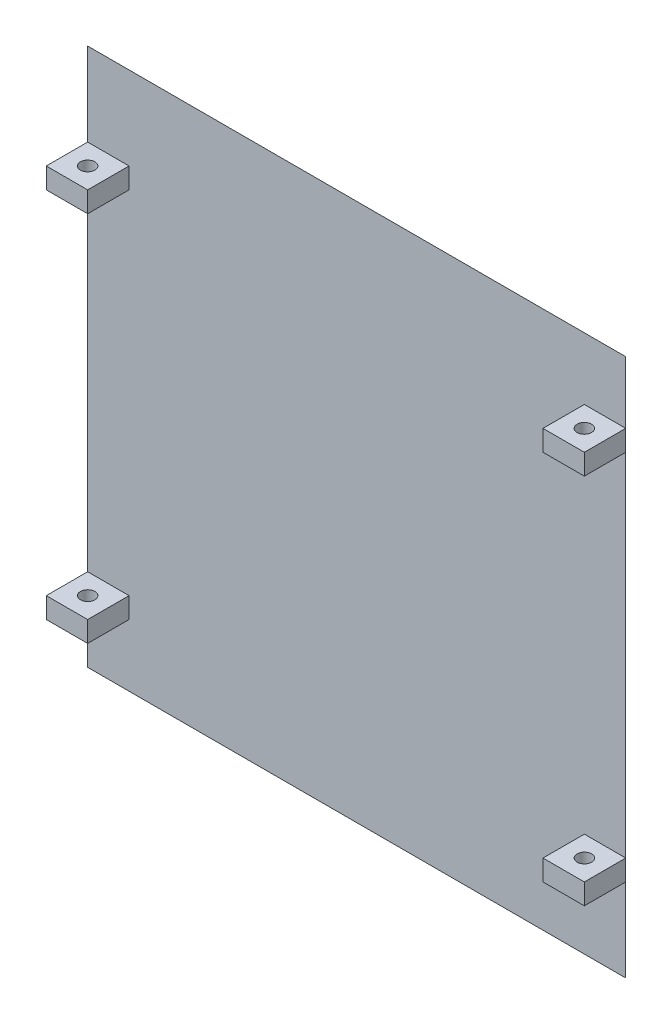
ISO-10303-21;
HEADER;
FILE_DESCRIPTION(('STEP AP214'),'2;1');
FILE_NAME('part.step','',(''),(''),'','','');
FILE_SCHEMA(('AUTOMOTIVE_DESIGN { 1 0 10303 214 1 1 1 1 }'));
ENDSEC;
DATA;
#1=APPLICATION_CONTEXT('core data for automotive mechanical design processes');
#2=APPLICATION_PROTOCOL_DEFINITION('international standard','automotive_design',2000,#1);
#3=PRODUCT_CONTEXT('',#1,'mechanical');
#4=PRODUCT('Part','Part','',(#3));
#5=PRODUCT_RELATED_PRODUCT_CATEGORY('part','',(#4));
#6=PRODUCT_DEFINITION_FORMATION('','',#4);
#7=PRODUCT_DEFINITION_CONTEXT('part definition',#1,'design');
#8=PRODUCT_DEFINITION('design','',#6,#7);
#9=PRODUCT_DEFINITION_SHAPE('','',#8);
#10=(LENGTH_UNIT() NAMED_UNIT(*) SI_UNIT(.MILLI.,.METRE.));
#11=(NAMED_UNIT(*) PLANE_ANGLE_UNIT() SI_UNIT($,.RADIAN.));
#12=(NAMED_UNIT(*) SI_UNIT($,.STERADIAN.) SOLID_ANGLE_UNIT());
#13=UNCERTAINTY_MEASURE_WITH_UNIT(LENGTH_MEASURE(1.E-05),#10,'distance_accuracy_value','');
#14=(GEOMETRIC_REPRESENTATION_CONTEXT(3) GLOBAL_UNCERTAINTY_ASSIGNED_CONTEXT((#13)) GLOBAL_UNIT_ASSIGNED_CONTEXT((#10,
#11,#12)) REPRESENTATION_CONTEXT('',''));
#15=CARTESIAN_POINT('',(0.,0.,0.));
#16=DIRECTION('',(0.,0.,1.));
#17=DIRECTION('',(1.,0.,0.));
#18=AXIS2_PLACEMENT_3D('',#15,#16,#17);
#19=CARTESIAN_POINT('',(0.,0.,3.));
#20=DIRECTION('',(0.,0.,1.));
#21=DIRECTION('',(1.,0.,0.));
#22=AXIS2_PLACEMENT_3D('',#19,#20,#21);
#23=PLANE('',#22);
#24=DIRECTION('',(0.,-1.,0.));
#25=VECTOR('',#24,1.);
#26=CARTESIAN_POINT('',(120.,110.,3.));
#27=LINE('',#26,#25);
#28=CARTESIAN_POINT('',(120.,115.,3.));
#29=VERTEX_POINT('',#28);
#30=CARTESIAN_POINT('',(120.,110.,3.));
#31=VERTEX_POINT('',#30);
#32=EDGE_CURVE('E50',#29,#31,#27,.T.);
#33=ORIENTED_EDGE('',*,*,#32,.F.);
#34=DIRECTION('',(-1.,0.,0.));
#35=VECTOR('',#34,1.);
#36=CARTESIAN_POINT('',(130.,115.,3.));
#37=LINE('',#36,#35);
#38=CARTESIAN_POINT('',(130.,115.,3.));
#39=VERTEX_POINT('',#38);
#40=EDGE_CURVE('E372',#39,#29,#37,.T.);
#41=ORIENTED_EDGE('',*,*,#40,.F.);
#42=DIRECTION('',(0.,1.,0.));
#43=VECTOR('',#42,1.);
#44=CARTESIAN_POINT('',(130.,130.,3.));
#45=LINE('',#44,#43);
#46=CARTESIAN_POINT('',(130.,130.,3.));
#47=VERTEX_POINT('',#46);
#48=EDGE_CURVE('E334',#39,#47,#45,.T.);
#49=ORIENTED_EDGE('',*,*,#48,.T.);
#50=DIRECTION('',(-1.,0.,0.));
#51=VECTOR('',#50,1.);
#52=CARTESIAN_POINT('',(0.,130.,3.));
#53=LINE('',#52,#51);
#54=CARTESIAN_POINT('',(0.,130.,3.));
#55=VERTEX_POINT('',#54);
#56=EDGE_CURVE('E329',#47,#55,#53,.T.);
#57=ORIENTED_EDGE('',*,*,#56,.T.);
#58=DIRECTION('',(0.,-1.,0.));
#59=VECTOR('',#58,1.);
#60=CARTESIAN_POINT('',(0.,130.,3.));
#61=LINE('',#60,#59);
#62=CARTESIAN_POINT('',(0.,109.9,3.));
#63=VERTEX_POINT('',#62);
#64=EDGE_CURVE('E298',#55,#63,#61,.T.);
#65=ORIENTED_EDGE('',*,*,#64,.T.);
#66=DIRECTION('',(-1.,0.,0.));
#67=VECTOR('',#66,1.);
#68=CARTESIAN_POINT('',(0.,109.9,3.));
#69=LINE('',#68,#67);
#70=CARTESIAN_POINT('',(9.99999999999999,109.9,3.));
#71=VERTEX_POINT('',#70);
#72=EDGE_CURVE('E238',#71,#63,#69,.T.);
#73=ORIENTED_EDGE('',*,*,#72,.F.);
#74=DIRECTION('',(0.,1.,0.));
#75=VECTOR('',#74,1.);
#76=CARTESIAN_POINT('',(9.99999999999999,109.9,3.));
#77=LINE('',#76,#75);
#78=CARTESIAN_POINT('',(9.99999999999999,104.9,3.));
#79=VERTEX_POINT('',#78);
#80=EDGE_CURVE('E250',#79,#71,#77,.T.);
#81=ORIENTED_EDGE('',*,*,#80,.F.);
#82=DIRECTION('',(1.,0.,0.));
#83=VECTOR('',#82,1.);
#84=CARTESIAN_POINT('',(0.,104.9,3.));
#85=LINE('',#84,#83);
#86=CARTESIAN_POINT('',(0.,104.9,3.));
#87=VERTEX_POINT('',#86);
#88=EDGE_CURVE('E247',#87,#79,#85,.T.);
#89=ORIENTED_EDGE('',*,*,#88,.F.);
#90=CARTESIAN_POINT('',(0.,20.,3.));
#91=VERTEX_POINT('',#90);
#92=EDGE_CURVE('E296',#87,#91,#61,.T.);
#93=ORIENTED_EDGE('',*,*,#92,.T.);
#94=DIRECTION('',(-1.,0.,0.));
#95=VECTOR('',#94,1.);
#96=CARTESIAN_POINT('',(0.,20.,3.));
#97=LINE('',#96,#95);
#98=CARTESIAN_POINT('',(9.99999999999999,20.,3.));
#99=VERTEX_POINT('',#98);
#100=EDGE_CURVE('E271',#99,#91,#97,.T.);
#101=ORIENTED_EDGE('',*,*,#100,.F.);
#102=DIRECTION('',(0.,1.,0.));
#103=VECTOR('',#102,1.);
#104=CARTESIAN_POINT('',(9.99999999999999,20.,3.));
#105=LINE('',#104,#103);
#106=CARTESIAN_POINT('',(9.99999999999999,15.,3.));
#107=VERTEX_POINT('',#106);
#108=EDGE_CURVE('E278',#107,#99,#105,.T.);
#109=ORIENTED_EDGE('',*,*,#108,.F.);
#110=DIRECTION('',(1.,0.,0.));
#111=VECTOR('',#110,1.);
#112=CARTESIAN_POINT('',(0.,15.,3.));
#113=LINE('',#112,#111);
#114=CARTESIAN_POINT('',(0.,15.,3.));
#115=VERTEX_POINT('',#114);
#116=EDGE_CURVE('E281',#115,#107,#113,.T.);
#117=ORIENTED_EDGE('',*,*,#116,.F.);
#118=CARTESIAN_POINT('',(0.,0.,3.));
#119=VERTEX_POINT('',#118);
#120=EDGE_CURVE('E299',#115,#119,#61,.T.);
#121=ORIENTED_EDGE('',*,*,#120,.T.);
#122=DIRECTION('',(1.,0.,0.));
#123=VECTOR('',#122,1.);
#124=CARTESIAN_POINT('',(0.,0.,3.));
#125=LINE('',#124,#123);
#126=CARTESIAN_POINT('',(130.,0.,3.));
#127=VERTEX_POINT('',#126);
#128=EDGE_CURVE('E304',#119,#127,#125,.T.);
#129=ORIENTED_EDGE('',*,*,#128,.T.);
#130=CARTESIAN_POINT('',(130.,20.1,3.));
#131=VERTEX_POINT('',#130);
#132=EDGE_CURVE('E331',#127,#131,#45,.T.);
#133=ORIENTED_EDGE('',*,*,#132,.T.);
#134=DIRECTION('',(1.,0.,0.));
#135=VECTOR('',#134,1.);
#136=CARTESIAN_POINT('',(130.,20.1,3.));
#137=LINE('',#136,#135);
#138=CARTESIAN_POINT('',(120.,20.1,3.));
#139=VERTEX_POINT('',#138);
#140=EDGE_CURVE('E208',#139,#131,#137,.T.);
#141=ORIENTED_EDGE('',*,*,#140,.F.);
#142=DIRECTION('',(0.,-1.,0.));
#143=VECTOR('',#142,1.);
#144=CARTESIAN_POINT('',(120.,20.1,3.));
#145=LINE('',#144,#143);
#146=CARTESIAN_POINT('',(120.,25.1,3.));
#147=VERTEX_POINT('',#146);
#148=EDGE_CURVE('E217',#147,#139,#145,.T.);
#149=ORIENTED_EDGE('',*,*,#148,.F.);
#150=DIRECTION('',(-1.,0.,0.));
#151=VECTOR('',#150,1.);
#152=CARTESIAN_POINT('',(130.,25.1,3.));
#153=LINE('',#152,#151);
#154=CARTESIAN_POINT('',(130.,25.1,3.));
#155=VERTEX_POINT('',#154);
#156=EDGE_CURVE('E198',#155,#147,#153,.T.);
#157=ORIENTED_EDGE('',*,*,#156,.F.);
#158=CARTESIAN_POINT('',(130.,110.,3.));
#159=VERTEX_POINT('',#158);
#160=EDGE_CURVE('E333',#155,#159,#45,.T.);
#161=ORIENTED_EDGE('',*,*,#160,.T.);
#162=DIRECTION('',(1.,0.,0.));
#163=VECTOR('',#162,1.);
#164=CARTESIAN_POINT('',(130.,110.,3.));
#165=LINE('',#164,#163);
#166=EDGE_CURVE('E55',#31,#159,#165,.T.);
#167=ORIENTED_EDGE('',*,*,#166,.F.);
#168=EDGE_LOOP('',(#33,#41,#49,#57,#65,#73,#81,#89,#93,#101,#109,#117,#121,#129,#133,#141,#149,
#157,#161,#167));
#169=FACE_BOUND('',#168,.T.);
#170=ADVANCED_FACE('F33',(#169),#23,.T.);
#171=CARTESIAN_POINT('',(0.,0.,0.));
#172=DIRECTION('',(0.,0.,1.));
#173=DIRECTION('',(1.,0.,0.));
#174=AXIS2_PLACEMENT_3D('',#171,#172,#173);
#175=PLANE('',#174);
#176=DIRECTION('',(0.,1.,0.));
#177=VECTOR('',#176,1.);
#178=CARTESIAN_POINT('',(3.,0.,0.));
#179=LINE('',#178,#177);
#180=CARTESIAN_POINT('',(3.,3.,0.));
#181=VERTEX_POINT('',#180);
#182=CARTESIAN_POINT('',(3.,127.,0.));
#183=VERTEX_POINT('',#182);
#184=EDGE_CURVE('E327',#181,#183,#179,.T.);
#185=ORIENTED_EDGE('',*,*,#184,.T.);
#186=DIRECTION('',(1.,0.,0.));
#187=VECTOR('',#186,1.);
#188=CARTESIAN_POINT('',(0.,127.,0.));
#189=LINE('',#188,#187);
#190=CARTESIAN_POINT('',(127.,127.,0.));
#191=VERTEX_POINT('',#190);
#192=EDGE_CURVE('E11',#183,#191,#189,.T.);
#193=ORIENTED_EDGE('',*,*,#192,.T.);
#194=DIRECTION('',(0.,-1.,0.));
#195=VECTOR('',#194,1.);
#196=CARTESIAN_POINT('',(127.,0.,0.));
#197=LINE('',#196,#195);
#198=CARTESIAN_POINT('',(127.,3.,0.));
#199=VERTEX_POINT('',#198);
#200=EDGE_CURVE('E42',#191,#199,#197,.T.);
#201=ORIENTED_EDGE('',*,*,#200,.T.);
#202=DIRECTION('',(-1.,0.,0.));
#203=VECTOR('',#202,1.);
#204=CARTESIAN_POINT('',(0.,3.,0.));
#205=LINE('',#204,#203);
#206=EDGE_CURVE('E325',#199,#181,#205,.T.);
#207=ORIENTED_EDGE('',*,*,#206,.T.);
#208=EDGE_LOOP('',(#185,#193,#201,#207));
#209=FACE_BOUND('',#208,.T.);
#210=ADVANCED_FACE('F419',(#209),#175,.F.);
#211=CARTESIAN_POINT('',(0.,0.,2.99999999999998));
#212=DIRECTION('',(0.,0.707106781186544,0.707106781186551));
#213=DIRECTION('',(1.,0.,0.));
#214=AXIS2_PLACEMENT_3D('',#211,#212,#213);
#215=PLANE('',#214);
#216=DIRECTION('',(-0.577350269189628,-0.577350269189628,0.577350269189622));
#217=VECTOR('',#216,1.);
#218=CARTESIAN_POINT('',(43.3333333333336,43.3333333333336,-40.3333333333332));
#219=LINE('',#218,#217);
#220=EDGE_CURVE('E316',#181,#119,#219,.T.);
#221=ORIENTED_EDGE('',*,*,#220,.F.);
#222=ORIENTED_EDGE('',*,*,#206,.F.);
#223=DIRECTION('',(0.577350269189631,-0.577350269189626,0.57735026918962));
#224=VECTOR('',#223,1.);
#225=CARTESIAN_POINT('',(86.6666666666658,43.3333333333337,-40.3333333333333));
#226=LINE('',#225,#224);
#227=EDGE_CURVE('E313',#127,#199,#226,.F.);
#228=ORIENTED_EDGE('',*,*,#227,.F.);
#229=ORIENTED_EDGE('',*,*,#128,.F.);
#230=EDGE_LOOP('',(#221,#222,#228,#229));
#231=FACE_BOUND('',#230,.T.);
#232=ADVANCED_FACE('F35',(#231),#215,.F.);
#233=CARTESIAN_POINT('',(130.,130.,2.99999999999998));
#234=DIRECTION('',(-0.707106781186541,0.,0.707106781186554));
#235=DIRECTION('',(0.,1.,0.));
#236=AXIS2_PLACEMENT_3D('',#233,#234,#235);
#237=PLANE('',#236);
#238=ORIENTED_EDGE('',*,*,#227,.T.);
#239=ORIENTED_EDGE('',*,*,#200,.F.);
#240=DIRECTION('',(0.577350269189631,0.577350269189626,0.577350269189621));
#241=VECTOR('',#240,1.);
#242=CARTESIAN_POINT('',(130.,130.,2.99999999999998));
#243=LINE('',#242,#241);
#244=EDGE_CURVE('E319',#47,#191,#243,.F.);
#245=ORIENTED_EDGE('',*,*,#244,.F.);
#246=ORIENTED_EDGE('',*,*,#48,.F.);
#247=DIRECTION('',(0.,1.,0.));
#248=VECTOR('',#247,1.);
#249=CARTESIAN_POINT('',(130.,110.,3.));
#250=LINE('',#249,#248);
#251=EDGE_CURVE('E194',#159,#39,#250,.T.);
#252=ORIENTED_EDGE('',*,*,#251,.F.);
#253=ORIENTED_EDGE('',*,*,#160,.F.);
#254=DIRECTION('',(0.,1.,0.));
#255=VECTOR('',#254,1.);
#256=CARTESIAN_POINT('',(130.,20.1,3.));
#257=LINE('',#256,#255);
#258=EDGE_CURVE('E195',#131,#155,#257,.T.);
#259=ORIENTED_EDGE('',*,*,#258,.F.);
#260=ORIENTED_EDGE('',*,*,#132,.F.);
#261=EDGE_LOOP('',(#238,#239,#245,#246,#252,#253,#259,#260));
#262=FACE_BOUND('',#261,.T.);
#263=ADVANCED_FACE('F345',(#262),#237,.F.);
#264=CARTESIAN_POINT('',(0.,130.,2.99999999999998));
#265=DIRECTION('',(0.707106781186544,0.,0.707106781186551));
#266=DIRECTION('',(0.,-1.,0.));
#267=AXIS2_PLACEMENT_3D('',#264,#265,#266);
#268=PLANE('',#267);
#269=ORIENTED_EDGE('',*,*,#220,.T.);
#270=ORIENTED_EDGE('',*,*,#120,.F.);
#271=DIRECTION('',(0.,-1.,0.));
#272=VECTOR('',#271,1.);
#273=CARTESIAN_POINT('',(0.,20.,3.));
#274=LINE('',#273,#272);
#275=EDGE_CURVE('E266',#91,#115,#274,.T.);
#276=ORIENTED_EDGE('',*,*,#275,.F.);
#277=ORIENTED_EDGE('',*,*,#92,.F.);
#278=DIRECTION('',(0.,-1.,0.));
#279=VECTOR('',#278,1.);
#280=CARTESIAN_POINT('',(0.,109.9,3.));
#281=LINE('',#280,#279);
#282=EDGE_CURVE('E233',#63,#87,#281,.T.);
#283=ORIENTED_EDGE('',*,*,#282,.F.);
#284=ORIENTED_EDGE('',*,*,#64,.F.);
#285=DIRECTION('',(0.577350269189628,-0.577350269189628,-0.577350269189622));
#286=VECTOR('',#285,1.);
#287=CARTESIAN_POINT('',(0.,130.,2.99999999999998));
#288=LINE('',#287,#286);
#289=EDGE_CURVE('E321',#183,#55,#288,.F.);
#290=ORIENTED_EDGE('',*,*,#289,.F.);
#291=ORIENTED_EDGE('',*,*,#184,.F.);
#292=EDGE_LOOP('',(#269,#270,#276,#277,#283,#284,#290,#291));
#293=FACE_BOUND('',#292,.T.);
#294=ADVANCED_FACE('F433',(#293),#268,.F.);
#295=CARTESIAN_POINT('',(0.,130.,2.99999999999998));
#296=DIRECTION('',(0.,-0.707106781186544,0.707106781186551));
#297=DIRECTION('',(-1.,0.,0.));
#298=AXIS2_PLACEMENT_3D('',#295,#296,#297);
#299=PLANE('',#298);
#300=ORIENTED_EDGE('',*,*,#244,.T.);
#301=ORIENTED_EDGE('',*,*,#192,.F.);
#302=ORIENTED_EDGE('',*,*,#289,.T.);
#303=ORIENTED_EDGE('',*,*,#56,.F.);
#304=EDGE_LOOP('',(#300,#301,#302,#303));
#305=FACE_BOUND('',#304,.T.);
#306=ADVANCED_FACE('F430',(#305),#299,.F.);
#307=CARTESIAN_POINT('',(0.,20.,13.));
#308=DIRECTION('',(1.,0.,0.));
#309=DIRECTION('',(0.,1.,0.));
#310=AXIS2_PLACEMENT_3D('',#307,#308,#309);
#311=PLANE('',#310);
#312=ORIENTED_EDGE('',*,*,#275,.T.);
#313=DIRECTION('',(0.,0.,-1.));
#314=VECTOR('',#313,1.);
#315=CARTESIAN_POINT('',(0.,15.,13.));
#316=LINE('',#315,#314);
#317=CARTESIAN_POINT('',(0.,15.,13.));
#318=VERTEX_POINT('',#317);
#319=EDGE_CURVE('E322',#318,#115,#316,.T.);
#320=ORIENTED_EDGE('',*,*,#319,.F.);
#321=DIRECTION('',(0.,-1.,0.));
#322=VECTOR('',#321,1.);
#323=CARTESIAN_POINT('',(0.,20.,13.));
#324=LINE('',#323,#322);
#325=CARTESIAN_POINT('',(0.,20.,13.));
#326=VERTEX_POINT('',#325);
#327=EDGE_CURVE('E267',#326,#318,#324,.T.);
#328=ORIENTED_EDGE('',*,*,#327,.F.);
#329=DIRECTION('',(0.,0.,-1.));
#330=VECTOR('',#329,1.);
#331=CARTESIAN_POINT('',(0.,20.,13.));
#332=LINE('',#331,#330);
#333=EDGE_CURVE('E277',#326,#91,#332,.T.);
#334=ORIENTED_EDGE('',*,*,#333,.T.);
#335=EDGE_LOOP('',(#312,#320,#328,#334));
#336=FACE_BOUND('',#335,.T.);
#337=ADVANCED_FACE('F427',(#336),#311,.F.);
#338=CARTESIAN_POINT('',(0.,15.,13.));
#339=DIRECTION('',(0.,1.,0.));
#340=DIRECTION('',(0.,0.,1.));
#341=AXIS2_PLACEMENT_3D('',#338,#339,#340);
#342=PLANE('',#341);
#343=CARTESIAN_POINT('',(4.99999999999999,15.,8.));
#344=DIRECTION('',(0.,-1.,0.));
#345=DIRECTION('',(0.,0.,-1.));
#346=AXIS2_PLACEMENT_3D('',#343,#344,#345);
#347=CIRCLE('',#346,1.75);
#348=CARTESIAN_POINT('',(4.99999999999999,15.,6.25));
#349=VERTEX_POINT('',#348);
#350=EDGE_CURVE('E382',#349,#349,#347,.T.);
#351=ORIENTED_EDGE('',*,*,#350,.F.);
#352=EDGE_LOOP('',(#351));
#353=FACE_BOUND('',#352,.T.);
#354=ORIENTED_EDGE('',*,*,#116,.T.);
#355=DIRECTION('',(0.,0.,-1.));
#356=VECTOR('',#355,1.);
#357=CARTESIAN_POINT('',(9.99999999999999,15.,13.));
#358=LINE('',#357,#356);
#359=CARTESIAN_POINT('',(9.99999999999999,15.,13.));
#360=VERTEX_POINT('',#359);
#361=EDGE_CURVE('E303',#360,#107,#358,.T.);
#362=ORIENTED_EDGE('',*,*,#361,.F.);
#363=DIRECTION('',(1.,0.,0.));
#364=VECTOR('',#363,1.);
#365=CARTESIAN_POINT('',(0.,15.,13.));
#366=LINE('',#365,#364);
#367=EDGE_CURVE('E270',#318,#360,#366,.T.);
#368=ORIENTED_EDGE('',*,*,#367,.F.);
#369=ORIENTED_EDGE('',*,*,#319,.T.);
#370=EDGE_LOOP('',(#354,#362,#368,#369));
#371=FACE_BOUND('',#370,.T.);
#372=ADVANCED_FACE('F477',(#353,#371),#342,.F.);
#373=CARTESIAN_POINT('',(9.99999999999999,20.,13.));
#374=DIRECTION('',(-1.,0.,0.));
#375=DIRECTION('',(0.,-1.,0.));
#376=AXIS2_PLACEMENT_3D('',#373,#374,#375);
#377=PLANE('',#376);
#378=ORIENTED_EDGE('',*,*,#108,.T.);
#379=DIRECTION('',(0.,0.,-1.));
#380=VECTOR('',#379,1.);
#381=CARTESIAN_POINT('',(9.99999999999999,20.,13.));
#382=LINE('',#381,#380);
#383=CARTESIAN_POINT('',(9.99999999999999,20.,13.));
#384=VERTEX_POINT('',#383);
#385=EDGE_CURVE('E284',#384,#99,#382,.T.);
#386=ORIENTED_EDGE('',*,*,#385,.F.);
#387=DIRECTION('',(0.,1.,0.));
#388=VECTOR('',#387,1.);
#389=CARTESIAN_POINT('',(9.99999999999999,20.,13.));
#390=LINE('',#389,#388);
#391=EDGE_CURVE('E273',#360,#384,#390,.T.);
#392=ORIENTED_EDGE('',*,*,#391,.F.);
#393=ORIENTED_EDGE('',*,*,#361,.T.);
#394=EDGE_LOOP('',(#378,#386,#392,#393));
#395=FACE_BOUND('',#394,.T.);
#396=ADVANCED_FACE('F486',(#395),#377,.F.);
#397=CARTESIAN_POINT('',(0.,20.,13.));
#398=DIRECTION('',(0.,-1.,0.));
#399=DIRECTION('',(0.,0.,-1.));
#400=AXIS2_PLACEMENT_3D('',#397,#398,#399);
#401=PLANE('',#400);
#402=CARTESIAN_POINT('',(4.99999999999999,20.,8.));
#403=DIRECTION('',(0.,-1.,0.));
#404=DIRECTION('',(0.,0.,-1.));
#405=AXIS2_PLACEMENT_3D('',#402,#403,#404);
#406=CIRCLE('',#405,1.75);
#407=CARTESIAN_POINT('',(4.99999999999999,20.,6.25));
#408=VERTEX_POINT('',#407);
#409=EDGE_CURVE('E374',#408,#408,#406,.T.);
#410=ORIENTED_EDGE('',*,*,#409,.T.);
#411=EDGE_LOOP('',(#410));
#412=FACE_BOUND('',#411,.T.);
#413=ORIENTED_EDGE('',*,*,#100,.T.);
#414=ORIENTED_EDGE('',*,*,#333,.F.);
#415=DIRECTION('',(-1.,0.,0.));
#416=VECTOR('',#415,1.);
#417=CARTESIAN_POINT('',(0.,20.,13.));
#418=LINE('',#417,#416);
#419=EDGE_CURVE('E275',#384,#326,#418,.T.);
#420=ORIENTED_EDGE('',*,*,#419,.F.);
#421=ORIENTED_EDGE('',*,*,#385,.T.);
#422=EDGE_LOOP('',(#413,#414,#420,#421));
#423=FACE_BOUND('',#422,.T.);
#424=ADVANCED_FACE('F495',(#412,#423),#401,.F.);
#425=CARTESIAN_POINT('',(0.,0.,13.));
#426=DIRECTION('',(0.,0.,1.));
#427=DIRECTION('',(1.,0.,0.));
#428=AXIS2_PLACEMENT_3D('',#425,#426,#427);
#429=PLANE('',#428);
#430=ORIENTED_EDGE('',*,*,#327,.T.);
#431=ORIENTED_EDGE('',*,*,#367,.T.);
#432=ORIENTED_EDGE('',*,*,#391,.T.);
#433=ORIENTED_EDGE('',*,*,#419,.T.);
#434=EDGE_LOOP('',(#430,#431,#432,#433));
#435=FACE_BOUND('',#434,.T.);
#436=ADVANCED_FACE('F504',(#435),#429,.T.);
#437=CARTESIAN_POINT('',(0.,109.9,13.));
#438=DIRECTION('',(1.,0.,0.));
#439=DIRECTION('',(0.,1.,0.));
#440=AXIS2_PLACEMENT_3D('',#437,#438,#439);
#441=PLANE('',#440);
#442=ORIENTED_EDGE('',*,*,#282,.T.);
#443=DIRECTION('',(0.,0.,-1.));
#444=VECTOR('',#443,1.);
#445=CARTESIAN_POINT('',(0.,104.9,13.));
#446=LINE('',#445,#444);
#447=CARTESIAN_POINT('',(0.,104.9,13.));
#448=VERTEX_POINT('',#447);
#449=EDGE_CURVE('E263',#448,#87,#446,.T.);
#450=ORIENTED_EDGE('',*,*,#449,.F.);
#451=DIRECTION('',(0.,-1.,0.));
#452=VECTOR('',#451,1.);
#453=CARTESIAN_POINT('',(0.,109.9,13.));
#454=LINE('',#453,#452);
#455=CARTESIAN_POINT('',(0.,109.9,13.));
#456=VERTEX_POINT('',#455);
#457=EDGE_CURVE('E234',#456,#448,#454,.T.);
#458=ORIENTED_EDGE('',*,*,#457,.F.);
#459=DIRECTION('',(0.,0.,-1.));
#460=VECTOR('',#459,1.);
#461=CARTESIAN_POINT('',(0.,109.9,13.));
#462=LINE('',#461,#460);
#463=EDGE_CURVE('E244',#456,#63,#462,.T.);
#464=ORIENTED_EDGE('',*,*,#463,.T.);
#465=EDGE_LOOP('',(#442,#450,#458,#464));
#466=FACE_BOUND('',#465,.T.);
#467=ADVANCED_FACE('F513',(#466),#441,.F.);
#468=CARTESIAN_POINT('',(0.,104.9,13.));
#469=DIRECTION('',(0.,1.,0.));
#470=DIRECTION('',(0.,0.,1.));
#471=AXIS2_PLACEMENT_3D('',#468,#469,#470);
#472=PLANE('',#471);
#473=CARTESIAN_POINT('',(4.99999999999999,104.9,8.));
#474=DIRECTION('',(0.,1.,0.));
#475=DIRECTION('',(0.,0.,1.));
#476=AXIS2_PLACEMENT_3D('',#473,#474,#475);
#477=CIRCLE('',#476,1.75);
#478=CARTESIAN_POINT('',(4.99999999999999,104.9,9.75));
#479=VERTEX_POINT('',#478);
#480=EDGE_CURVE('E379',#479,#479,#477,.T.);
#481=ORIENTED_EDGE('',*,*,#480,.T.);
#482=EDGE_LOOP('',(#481));
#483=FACE_BOUND('',#482,.T.);
#484=ORIENTED_EDGE('',*,*,#88,.T.);
#485=DIRECTION('',(0.,0.,-1.));
#486=VECTOR('',#485,1.);
#487=CARTESIAN_POINT('',(9.99999999999999,104.9,13.));
#488=LINE('',#487,#486);
#489=CARTESIAN_POINT('',(9.99999999999999,104.9,13.));
#490=VERTEX_POINT('',#489);
#491=EDGE_CURVE('E260',#490,#79,#488,.T.);
#492=ORIENTED_EDGE('',*,*,#491,.F.);
#493=DIRECTION('',(1.,0.,0.));
#494=VECTOR('',#493,1.);
#495=CARTESIAN_POINT('',(0.,104.9,13.));
#496=LINE('',#495,#494);
#497=EDGE_CURVE('E237',#448,#490,#496,.T.);
#498=ORIENTED_EDGE('',*,*,#497,.F.);
#499=ORIENTED_EDGE('',*,*,#449,.T.);
#500=EDGE_LOOP('',(#484,#492,#498,#499));
#501=FACE_BOUND('',#500,.T.);
#502=ADVANCED_FACE('F522',(#483,#501),#472,.F.);
#503=CARTESIAN_POINT('',(9.99999999999999,109.9,13.));
#504=DIRECTION('',(-1.,0.,0.));
#505=DIRECTION('',(0.,0.,1.));
#506=AXIS2_PLACEMENT_3D('',#503,#504,#505);
#507=PLANE('',#506);
#508=ORIENTED_EDGE('',*,*,#80,.T.);
#509=DIRECTION('',(0.,0.,-1.));
#510=VECTOR('',#509,1.);
#511=CARTESIAN_POINT('',(9.99999999999999,109.9,13.));
#512=LINE('',#511,#510);
#513=CARTESIAN_POINT('',(9.99999999999999,109.9,13.));
#514=VERTEX_POINT('',#513);
#515=EDGE_CURVE('E257',#514,#71,#512,.T.);
#516=ORIENTED_EDGE('',*,*,#515,.F.);
#517=DIRECTION('',(0.,1.,0.));
#518=VECTOR('',#517,1.);
#519=CARTESIAN_POINT('',(9.99999999999999,109.9,13.));
#520=LINE('',#519,#518);
#521=EDGE_CURVE('E240',#490,#514,#520,.T.);
#522=ORIENTED_EDGE('',*,*,#521,.F.);
#523=ORIENTED_EDGE('',*,*,#491,.T.);
#524=EDGE_LOOP('',(#508,#516,#522,#523));
#525=FACE_BOUND('',#524,.T.);
#526=ADVANCED_FACE('F531',(#525),#507,.F.);
#527=CARTESIAN_POINT('',(0.,109.9,13.));
#528=DIRECTION('',(0.,-1.,0.));
#529=DIRECTION('',(0.,0.,-1.));
#530=AXIS2_PLACEMENT_3D('',#527,#528,#529);
#531=PLANE('',#530);
#532=CARTESIAN_POINT('',(4.99999999999999,109.9,8.));
#533=DIRECTION('',(0.,-1.,0.));
#534=DIRECTION('',(0.,0.,-1.));
#535=AXIS2_PLACEMENT_3D('',#532,#533,#534);
#536=CIRCLE('',#535,1.75);
#537=CARTESIAN_POINT('',(4.99999999999999,109.9,6.25));
#538=VERTEX_POINT('',#537);
#539=EDGE_CURVE('E300',#538,#538,#536,.T.);
#540=ORIENTED_EDGE('',*,*,#539,.T.);
#541=EDGE_LOOP('',(#540));
#542=FACE_BOUND('',#541,.T.);
#543=ORIENTED_EDGE('',*,*,#72,.T.);
#544=ORIENTED_EDGE('',*,*,#463,.F.);
#545=DIRECTION('',(-1.,0.,0.));
#546=VECTOR('',#545,1.);
#547=CARTESIAN_POINT('',(0.,109.9,13.));
#548=LINE('',#547,#546);
#549=EDGE_CURVE('E242',#514,#456,#548,.T.);
#550=ORIENTED_EDGE('',*,*,#549,.F.);
#551=ORIENTED_EDGE('',*,*,#515,.T.);
#552=EDGE_LOOP('',(#543,#544,#550,#551));
#553=FACE_BOUND('',#552,.T.);
#554=ADVANCED_FACE('F540',(#542,#553),#531,.F.);
#555=CARTESIAN_POINT('',(0.,0.,13.));
#556=DIRECTION('',(0.,0.,1.));
#557=DIRECTION('',(1.,0.,0.));
#558=AXIS2_PLACEMENT_3D('',#555,#556,#557);
#559=PLANE('',#558);
#560=ORIENTED_EDGE('',*,*,#457,.T.);
#561=ORIENTED_EDGE('',*,*,#497,.T.);
#562=ORIENTED_EDGE('',*,*,#521,.T.);
#563=ORIENTED_EDGE('',*,*,#549,.T.);
#564=EDGE_LOOP('',(#560,#561,#562,#563));
#565=FACE_BOUND('',#564,.T.);
#566=ADVANCED_FACE('F549',(#565),#559,.T.);
#567=CARTESIAN_POINT('',(130.,20.1,13.));
#568=DIRECTION('',(-1.,0.,0.));
#569=DIRECTION('',(0.,0.,1.));
#570=AXIS2_PLACEMENT_3D('',#567,#568,#569);
#571=PLANE('',#570);
#572=ORIENTED_EDGE('',*,*,#258,.T.);
#573=DIRECTION('',(0.,0.,-1.));
#574=VECTOR('',#573,1.);
#575=CARTESIAN_POINT('',(130.,25.1,13.));
#576=LINE('',#575,#574);
#577=CARTESIAN_POINT('',(130.,25.1,13.));
#578=VERTEX_POINT('',#577);
#579=EDGE_CURVE('E230',#578,#155,#576,.T.);
#580=ORIENTED_EDGE('',*,*,#579,.F.);
#581=DIRECTION('',(0.,1.,0.));
#582=VECTOR('',#581,1.);
#583=CARTESIAN_POINT('',(130.,20.1,13.));
#584=LINE('',#583,#582);
#585=CARTESIAN_POINT('',(130.,20.1,13.));
#586=VERTEX_POINT('',#585);
#587=EDGE_CURVE('E204',#586,#578,#584,.T.);
#588=ORIENTED_EDGE('',*,*,#587,.F.);
#589=DIRECTION('',(0.,0.,-1.));
#590=VECTOR('',#589,1.);
#591=CARTESIAN_POINT('',(130.,20.1,13.));
#592=LINE('',#591,#590);
#593=EDGE_CURVE('E213',#586,#131,#592,.T.);
#594=ORIENTED_EDGE('',*,*,#593,.T.);
#595=EDGE_LOOP('',(#572,#580,#588,#594));
#596=FACE_BOUND('',#595,.T.);
#597=ADVANCED_FACE('F349',(#596),#571,.F.);
#598=CARTESIAN_POINT('',(130.,25.1,13.));
#599=DIRECTION('',(0.,-1.,0.));
#600=DIRECTION('',(1.,0.,0.));
#601=AXIS2_PLACEMENT_3D('',#598,#599,#600);
#602=PLANE('',#601);
#603=CARTESIAN_POINT('',(125.,25.1,8.));
#604=DIRECTION('',(0.,-1.,0.));
#605=DIRECTION('',(1.,0.,0.));
#606=AXIS2_PLACEMENT_3D('',#603,#604,#605);
#607=CIRCLE('',#606,1.75000000000001);
#608=CARTESIAN_POINT('',(126.75,25.1,8.));
#609=VERTEX_POINT('',#608);
#610=EDGE_CURVE('E385',#609,#609,#607,.T.);
#611=ORIENTED_EDGE('',*,*,#610,.T.);
#612=EDGE_LOOP('',(#611));
#613=FACE_BOUND('',#612,.T.);
#614=ORIENTED_EDGE('',*,*,#156,.T.);
#615=DIRECTION('',(0.,0.,-1.));
#616=VECTOR('',#615,1.);
#617=CARTESIAN_POINT('',(120.,25.1,13.));
#618=LINE('',#617,#616);
#619=CARTESIAN_POINT('',(120.,25.1,13.));
#620=VERTEX_POINT('',#619);
#621=EDGE_CURVE('E227',#620,#147,#618,.T.);
#622=ORIENTED_EDGE('',*,*,#621,.F.);
#623=DIRECTION('',(-1.,0.,0.));
#624=VECTOR('',#623,1.);
#625=CARTESIAN_POINT('',(130.,25.1,13.));
#626=LINE('',#625,#624);
#627=EDGE_CURVE('E207',#578,#620,#626,.T.);
#628=ORIENTED_EDGE('',*,*,#627,.F.);
#629=ORIENTED_EDGE('',*,*,#579,.T.);
#630=EDGE_LOOP('',(#614,#622,#628,#629));
#631=FACE_BOUND('',#630,.T.);
#632=ADVANCED_FACE('F361',(#613,#631),#602,.F.);
#633=CARTESIAN_POINT('',(120.,20.1,13.));
#634=DIRECTION('',(1.,0.,0.));
#635=DIRECTION('',(0.,0.,-1.));
#636=AXIS2_PLACEMENT_3D('',#633,#634,#635);
#637=PLANE('',#636);
#638=ORIENTED_EDGE('',*,*,#148,.T.);
#639=DIRECTION('',(0.,0.,-1.));
#640=VECTOR('',#639,1.);
#641=CARTESIAN_POINT('',(120.,20.1,13.));
#642=LINE('',#641,#640);
#643=CARTESIAN_POINT('',(120.,20.1,13.));
#644=VERTEX_POINT('',#643);
#645=EDGE_CURVE('E224',#644,#139,#642,.T.);
#646=ORIENTED_EDGE('',*,*,#645,.F.);
#647=DIRECTION('',(0.,-1.,0.));
#648=VECTOR('',#647,1.);
#649=CARTESIAN_POINT('',(120.,20.1,13.));
#650=LINE('',#649,#648);
#651=EDGE_CURVE('E210',#620,#644,#650,.T.);
#652=ORIENTED_EDGE('',*,*,#651,.F.);
#653=ORIENTED_EDGE('',*,*,#621,.T.);
#654=EDGE_LOOP('',(#638,#646,#652,#653));
#655=FACE_BOUND('',#654,.T.);
#656=ADVANCED_FACE('F357',(#655),#637,.F.);
#657=CARTESIAN_POINT('',(130.,20.1,13.));
#658=DIRECTION('',(0.,1.,0.));
#659=DIRECTION('',(0.,0.,1.));
#660=AXIS2_PLACEMENT_3D('',#657,#658,#659);
#661=PLANE('',#660);
#662=CARTESIAN_POINT('',(125.,20.1,8.));
#663=DIRECTION('',(0.,-1.,0.));
#664=DIRECTION('',(0.,0.,-1.));
#665=AXIS2_PLACEMENT_3D('',#662,#663,#664);
#666=CIRCLE('',#665,1.75000000000001);
#667=CARTESIAN_POINT('',(125.,20.1,6.24999999999999));
#668=VERTEX_POINT('',#667);
#669=EDGE_CURVE('E391',#668,#668,#666,.T.);
#670=ORIENTED_EDGE('',*,*,#669,.F.);
#671=EDGE_LOOP('',(#670));
#672=FACE_BOUND('',#671,.T.);
#673=ORIENTED_EDGE('',*,*,#140,.T.);
#674=ORIENTED_EDGE('',*,*,#593,.F.);
#675=DIRECTION('',(1.,0.,0.));
#676=VECTOR('',#675,1.);
#677=CARTESIAN_POINT('',(130.,20.1,13.));
#678=LINE('',#677,#676);
#679=EDGE_CURVE('E212',#644,#586,#678,.T.);
#680=ORIENTED_EDGE('',*,*,#679,.F.);
#681=ORIENTED_EDGE('',*,*,#645,.T.);
#682=EDGE_LOOP('',(#673,#674,#680,#681));
#683=FACE_BOUND('',#682,.T.);
#684=ADVANCED_FACE('F354',(#672,#683),#661,.F.);
#685=CARTESIAN_POINT('',(0.,0.,13.));
#686=DIRECTION('',(0.,0.,1.));
#687=DIRECTION('',(1.,0.,0.));
#688=AXIS2_PLACEMENT_3D('',#685,#686,#687);
#689=PLANE('',#688);
#690=ORIENTED_EDGE('',*,*,#587,.T.);
#691=ORIENTED_EDGE('',*,*,#627,.T.);
#692=ORIENTED_EDGE('',*,*,#651,.T.);
#693=ORIENTED_EDGE('',*,*,#679,.T.);
#694=EDGE_LOOP('',(#690,#691,#692,#693));
#695=FACE_BOUND('',#694,.T.);
#696=ADVANCED_FACE('F416',(#695),#689,.T.);
#697=CARTESIAN_POINT('',(130.,110.,13.));
#698=DIRECTION('',(-1.,0.,0.));
#699=DIRECTION('',(0.,0.,1.));
#700=AXIS2_PLACEMENT_3D('',#697,#698,#699);
#701=PLANE('',#700);
#702=ORIENTED_EDGE('',*,*,#251,.T.);
#703=DIRECTION('',(0.,0.,-1.));
#704=VECTOR('',#703,1.);
#705=CARTESIAN_POINT('',(130.,115.,13.));
#706=LINE('',#705,#704);
#707=CARTESIAN_POINT('',(130.,115.,13.));
#708=VERTEX_POINT('',#707);
#709=EDGE_CURVE('E176',#708,#39,#706,.T.);
#710=ORIENTED_EDGE('',*,*,#709,.F.);
#711=DIRECTION('',(0.,1.,0.));
#712=VECTOR('',#711,1.);
#713=CARTESIAN_POINT('',(130.,110.,13.));
#714=LINE('',#713,#712);
#715=CARTESIAN_POINT('',(130.,110.,13.));
#716=VERTEX_POINT('',#715);
#717=EDGE_CURVE('E183',#716,#708,#714,.T.);
#718=ORIENTED_EDGE('',*,*,#717,.F.);
#719=DIRECTION('',(0.,0.,-1.));
#720=VECTOR('',#719,1.);
#721=CARTESIAN_POINT('',(130.,110.,13.));
#722=LINE('',#721,#720);
#723=EDGE_CURVE('E365',#716,#159,#722,.T.);
#724=ORIENTED_EDGE('',*,*,#723,.T.);
#725=EDGE_LOOP('',(#702,#710,#718,#724));
#726=FACE_BOUND('',#725,.T.);
#727=ADVANCED_FACE('F193',(#726),#701,.F.);
#728=CARTESIAN_POINT('',(130.,115.,13.));
#729=DIRECTION('',(0.,-1.,0.));
#730=DIRECTION('',(0.,0.,-1.));
#731=AXIS2_PLACEMENT_3D('',#728,#729,#730);
#732=PLANE('',#731);
#733=CARTESIAN_POINT('',(125.,115.,8.));
#734=DIRECTION('',(0.,-1.,0.));
#735=DIRECTION('',(0.,0.,-1.));
#736=AXIS2_PLACEMENT_3D('',#733,#734,#735);
#737=CIRCLE('',#736,1.75000000000001);
#738=CARTESIAN_POINT('',(125.,115.,6.24999999999999));
#739=VERTEX_POINT('',#738);
#740=EDGE_CURVE('E388',#739,#739,#737,.T.);
#741=ORIENTED_EDGE('',*,*,#740,.T.);
#742=EDGE_LOOP('',(#741));
#743=FACE_BOUND('',#742,.T.);
#744=ORIENTED_EDGE('',*,*,#40,.T.);
#745=DIRECTION('',(0.,0.,-1.));
#746=VECTOR('',#745,1.);
#747=CARTESIAN_POINT('',(120.,115.,13.));
#748=LINE('',#747,#746);
#749=CARTESIAN_POINT('',(120.,115.,13.));
#750=VERTEX_POINT('',#749);
#751=EDGE_CURVE('E179',#750,#29,#748,.T.);
#752=ORIENTED_EDGE('',*,*,#751,.F.);
#753=DIRECTION('',(-1.,0.,0.));
#754=VECTOR('',#753,1.);
#755=CARTESIAN_POINT('',(130.,115.,13.));
#756=LINE('',#755,#754);
#757=EDGE_CURVE('E172',#708,#750,#756,.T.);
#758=ORIENTED_EDGE('',*,*,#757,.F.);
#759=ORIENTED_EDGE('',*,*,#709,.T.);
#760=EDGE_LOOP('',(#744,#752,#758,#759));
#761=FACE_BOUND('',#760,.T.);
#762=ADVANCED_FACE('F174',(#743,#761),#732,.F.);
#763=CARTESIAN_POINT('',(120.,110.,13.));
#764=DIRECTION('',(1.,0.,0.));
#765=DIRECTION('',(0.,1.,0.));
#766=AXIS2_PLACEMENT_3D('',#763,#764,#765);
#767=PLANE('',#766);
#768=ORIENTED_EDGE('',*,*,#32,.T.);
#769=DIRECTION('',(0.,0.,-1.));
#770=VECTOR('',#769,1.);
#771=CARTESIAN_POINT('',(120.,110.,13.));
#772=LINE('',#771,#770);
#773=CARTESIAN_POINT('',(120.,110.,13.));
#774=VERTEX_POINT('',#773);
#775=EDGE_CURVE('E200',#774,#31,#772,.T.);
#776=ORIENTED_EDGE('',*,*,#775,.F.);
#777=DIRECTION('',(0.,-1.,0.));
#778=VECTOR('',#777,1.);
#779=CARTESIAN_POINT('',(120.,110.,13.));
#780=LINE('',#779,#778);
#781=EDGE_CURVE('E182',#750,#774,#780,.T.);
#782=ORIENTED_EDGE('',*,*,#781,.F.);
#783=ORIENTED_EDGE('',*,*,#751,.T.);
#784=EDGE_LOOP('',(#768,#776,#782,#783));
#785=FACE_BOUND('',#784,.T.);
#786=ADVANCED_FACE('F408',(#785),#767,.F.);
#787=CARTESIAN_POINT('',(130.,110.,13.));
#788=DIRECTION('',(0.,1.,0.));
#789=DIRECTION('',(0.,0.,1.));
#790=AXIS2_PLACEMENT_3D('',#787,#788,#789);
#791=PLANE('',#790);
#792=CARTESIAN_POINT('',(125.,110.,8.));
#793=DIRECTION('',(0.,1.,0.));
#794=DIRECTION('',(0.,0.,1.));
#795=AXIS2_PLACEMENT_3D('',#792,#793,#794);
#796=CIRCLE('',#795,1.75000000000001);
#797=CARTESIAN_POINT('',(125.,110.,9.75000000000001));
#798=VERTEX_POINT('',#797);
#799=EDGE_CURVE('E37',#798,#798,#796,.T.);
#800=ORIENTED_EDGE('',*,*,#799,.T.);
#801=EDGE_LOOP('',(#800));
#802=FACE_BOUND('',#801,.T.);
#803=ORIENTED_EDGE('',*,*,#166,.T.);
#804=ORIENTED_EDGE('',*,*,#723,.F.);
#805=DIRECTION('',(1.,0.,0.));
#806=VECTOR('',#805,1.);
#807=CARTESIAN_POINT('',(130.,110.,13.));
#808=LINE('',#807,#806);
#809=EDGE_CURVE('E188',#774,#716,#808,.T.);
#810=ORIENTED_EDGE('',*,*,#809,.F.);
#811=ORIENTED_EDGE('',*,*,#775,.T.);
#812=EDGE_LOOP('',(#803,#804,#810,#811));
#813=FACE_BOUND('',#812,.T.);
#814=ADVANCED_FACE('F364',(#802,#813),#791,.F.);
#815=CARTESIAN_POINT('',(0.,0.,13.));
#816=DIRECTION('',(0.,0.,1.));
#817=DIRECTION('',(1.,0.,0.));
#818=AXIS2_PLACEMENT_3D('',#815,#816,#817);
#819=PLANE('',#818);
#820=ORIENTED_EDGE('',*,*,#717,.T.);
#821=ORIENTED_EDGE('',*,*,#757,.T.);
#822=ORIENTED_EDGE('',*,*,#781,.T.);
#823=ORIENTED_EDGE('',*,*,#809,.T.);
#824=EDGE_LOOP('',(#820,#821,#822,#823));
#825=FACE_BOUND('',#824,.T.);
#826=ADVANCED_FACE('F186',(#825),#819,.T.);
#827=CARTESIAN_POINT('',(4.99999999999999,130.000025,8.));
#828=DIRECTION('',(0.,-1.,0.));
#829=DIRECTION('',(0.,0.,-1.));
#830=AXIS2_PLACEMENT_3D('',#827,#828,#829);
#831=CYLINDRICAL_SURFACE('',#830,1.75);
#832=ORIENTED_EDGE('',*,*,#539,.F.);
#833=EDGE_LOOP('',(#832));
#834=FACE_BOUND('',#833,.T.);
#835=ORIENTED_EDGE('',*,*,#480,.F.);
#836=EDGE_LOOP('',(#835));
#837=FACE_BOUND('',#836,.T.);
#838=ADVANCED_FACE('F626',(#834,#837),#831,.F.);
#839=ORIENTED_EDGE('',*,*,#350,.T.);
#840=EDGE_LOOP('',(#839));
#841=FACE_BOUND('',#840,.T.);
#842=ORIENTED_EDGE('',*,*,#409,.F.);
#843=EDGE_LOOP('',(#842));
#844=FACE_BOUND('',#843,.T.);
#845=ADVANCED_FACE('F403',(#841,#844),#831,.F.);
#846=CARTESIAN_POINT('',(125.,130.000025,8.));
#847=DIRECTION('',(0.,-1.,0.));
#848=DIRECTION('',(0.,0.,-1.));
#849=AXIS2_PLACEMENT_3D('',#846,#847,#848);
#850=CYLINDRICAL_SURFACE('',#849,1.75000000000001);
#851=ORIENTED_EDGE('',*,*,#799,.F.);
#852=EDGE_LOOP('',(#851));
#853=FACE_BOUND('',#852,.T.);
#854=ORIENTED_EDGE('',*,*,#740,.F.);
#855=EDGE_LOOP('',(#854));
#856=FACE_BOUND('',#855,.T.);
#857=ADVANCED_FACE('F399',(#853,#856),#850,.F.);
#858=ORIENTED_EDGE('',*,*,#669,.T.);
#859=EDGE_LOOP('',(#858));
#860=FACE_BOUND('',#859,.T.);
#861=ORIENTED_EDGE('',*,*,#610,.F.);
#862=EDGE_LOOP('',(#861));
#863=FACE_BOUND('',#862,.T.);
#864=ADVANCED_FACE('F402',(#860,#863),#850,.F.);
#865=CLOSED_SHELL('',(#170,#210,#232,#263,#294,#306,#337,#372,#396,#424,#436,#467,#502,#526,
#554,#566,#597,#632,#656,#684,#696,#727,#762,#786,#814,#826,#838,#845,#857,#864));
#866=MANIFOLD_SOLID_BREP('B2',#865);
#867=ADVANCED_BREP_SHAPE_REPRESENTATION('',(#18,#866),#14);
#868=SHAPE_DEFINITION_REPRESENTATION(#9,#867);
ENDSEC;
END-ISO-10303-21;
